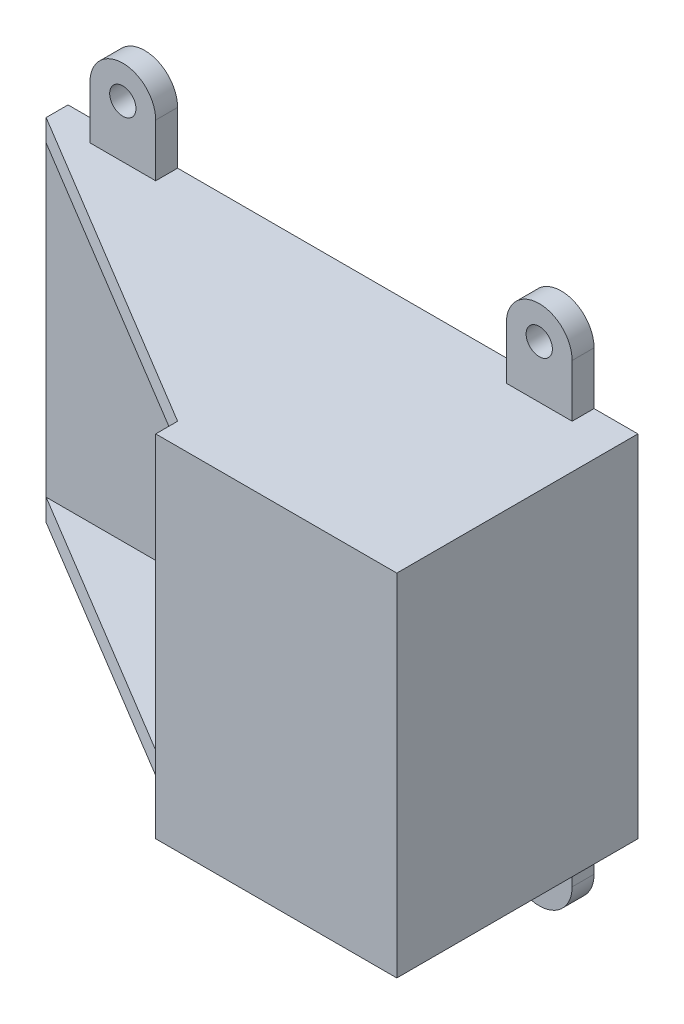
ISO-10303-21;
HEADER;
FILE_DESCRIPTION(('STEP AP214'),'2;1');
FILE_NAME('part.step','',(''),(''),'','','');
FILE_SCHEMA(('AUTOMOTIVE_DESIGN { 1 0 10303 214 1 1 1 1 }'));
ENDSEC;
DATA;
#1=APPLICATION_CONTEXT('core data for automotive mechanical design processes');
#2=APPLICATION_PROTOCOL_DEFINITION('international standard','automotive_design',2000,#1);
#3=PRODUCT_CONTEXT('',#1,'mechanical');
#4=PRODUCT('Part','Part','',(#3));
#5=PRODUCT_RELATED_PRODUCT_CATEGORY('part','',(#4));
#6=PRODUCT_DEFINITION_FORMATION('','',#4);
#7=PRODUCT_DEFINITION_CONTEXT('part definition',#1,'design');
#8=PRODUCT_DEFINITION('design','',#6,#7);
#9=PRODUCT_DEFINITION_SHAPE('','',#8);
#10=(LENGTH_UNIT() NAMED_UNIT(*) SI_UNIT(.MILLI.,.METRE.));
#11=(NAMED_UNIT(*) PLANE_ANGLE_UNIT() SI_UNIT($,.RADIAN.));
#12=(NAMED_UNIT(*) SI_UNIT($,.STERADIAN.) SOLID_ANGLE_UNIT());
#13=UNCERTAINTY_MEASURE_WITH_UNIT(LENGTH_MEASURE(1.E-05),#10,'distance_accuracy_value','');
#14=(GEOMETRIC_REPRESENTATION_CONTEXT(3) GLOBAL_UNCERTAINTY_ASSIGNED_CONTEXT((#13)) GLOBAL_UNIT_ASSIGNED_CONTEXT((#10,
#11,#12)) REPRESENTATION_CONTEXT('',''));
#15=CARTESIAN_POINT('',(0.,0.,0.));
#16=DIRECTION('',(0.,0.,1.));
#17=DIRECTION('',(1.,0.,0.));
#18=AXIS2_PLACEMENT_3D('',#15,#16,#17);
#19=CARTESIAN_POINT('',(0.,75.,0.));
#20=DIRECTION('',(0.,-1.,0.));
#21=DIRECTION('',(0.,0.,-1.));
#22=AXIS2_PLACEMENT_3D('',#19,#20,#21);
#23=PLANE('',#22);
#24=DIRECTION('',(1.,0.,0.));
#25=VECTOR('',#24,1.);
#26=CARTESIAN_POINT('',(95.,75.,5.));
#27=LINE('',#26,#25);
#28=CARTESIAN_POINT('',(105.,75.,5.));
#29=VERTEX_POINT('',#28);
#30=CARTESIAN_POINT('',(120.,75.,5.));
#31=VERTEX_POINT('',#30);
#32=EDGE_CURVE('E234',#29,#31,#27,.T.);
#33=ORIENTED_EDGE('',*,*,#32,.F.);
#34=DIRECTION('',(0.,0.,-1.));
#35=VECTOR('',#34,1.);
#36=CARTESIAN_POINT('',(105.,75.,5.));
#37=LINE('',#36,#35);
#38=CARTESIAN_POINT('',(105.,75.,0.));
#39=VERTEX_POINT('',#38);
#40=EDGE_CURVE('E219',#29,#39,#37,.T.);
#41=ORIENTED_EDGE('',*,*,#40,.T.);
#42=DIRECTION('',(1.,0.,0.));
#43=VECTOR('',#42,1.);
#44=CARTESIAN_POINT('',(0.,75.,0.));
#45=LINE('',#44,#43);
#46=CARTESIAN_POINT('',(25.,75.,0.));
#47=VERTEX_POINT('',#46);
#48=EDGE_CURVE('E397',#47,#39,#45,.T.);
#49=ORIENTED_EDGE('',*,*,#48,.F.);
#50=DIRECTION('',(0.,0.,-1.));
#51=VECTOR('',#50,1.);
#52=CARTESIAN_POINT('',(25.,75.,5.));
#53=LINE('',#52,#51);
#54=CARTESIAN_POINT('',(25.,75.,5.));
#55=VERTEX_POINT('',#54);
#56=EDGE_CURVE('E277',#55,#47,#53,.T.);
#57=ORIENTED_EDGE('',*,*,#56,.F.);
#58=DIRECTION('',(1.,0.,0.));
#59=VECTOR('',#58,1.);
#60=CARTESIAN_POINT('',(0.,75.,5.));
#61=LINE('',#60,#59);
#62=CARTESIAN_POINT('',(10.,75.,5.));
#63=VERTEX_POINT('',#62);
#64=EDGE_CURVE('E260',#63,#55,#61,.T.);
#65=ORIENTED_EDGE('',*,*,#64,.F.);
#66=DIRECTION('',(0.,0.,-1.));
#67=VECTOR('',#66,1.);
#68=CARTESIAN_POINT('',(10.,75.,5.));
#69=LINE('',#68,#67);
#70=CARTESIAN_POINT('',(10.,75.,0.));
#71=VERTEX_POINT('',#70);
#72=EDGE_CURVE('E279',#63,#71,#69,.T.);
#73=ORIENTED_EDGE('',*,*,#72,.T.);
#74=CARTESIAN_POINT('',(0.,75.,0.));
#75=VERTEX_POINT('',#74);
#76=EDGE_CURVE('E394',#75,#71,#45,.T.);
#77=ORIENTED_EDGE('',*,*,#76,.F.);
#78=DIRECTION('',(0.,0.,-1.));
#79=VECTOR('',#78,1.);
#80=CARTESIAN_POINT('',(0.,75.,5.));
#81=LINE('',#80,#79);
#82=CARTESIAN_POINT('',(0.,75.,5.));
#83=VERTEX_POINT('',#82);
#84=EDGE_CURVE('E379',#83,#75,#81,.T.);
#85=ORIENTED_EDGE('',*,*,#84,.F.);
#86=DIRECTION('',(-0.857492925712544,0.,-0.514495755427527));
#87=VECTOR('',#86,1.);
#88=CARTESIAN_POINT('',(75.,75.,50.));
#89=LINE('',#88,#87);
#90=CARTESIAN_POINT('',(75.,75.,50.));
#91=VERTEX_POINT('',#90);
#92=EDGE_CURVE('E385',#91,#83,#89,.T.);
#93=ORIENTED_EDGE('',*,*,#92,.F.);
#94=DIRECTION('',(0.,0.,-1.));
#95=VECTOR('',#94,1.);
#96=CARTESIAN_POINT('',(75.,75.,55.));
#97=LINE('',#96,#95);
#98=CARTESIAN_POINT('',(75.,75.,55.));
#99=VERTEX_POINT('',#98);
#100=EDGE_CURVE('E367',#99,#91,#97,.T.);
#101=ORIENTED_EDGE('',*,*,#100,.F.);
#102=DIRECTION('',(-1.,0.,0.));
#103=VECTOR('',#102,1.);
#104=CARTESIAN_POINT('',(130.,75.,55.));
#105=LINE('',#104,#103);
#106=CARTESIAN_POINT('',(130.,75.,55.));
#107=VERTEX_POINT('',#106);
#108=EDGE_CURVE('E355',#107,#99,#105,.T.);
#109=ORIENTED_EDGE('',*,*,#108,.F.);
#110=DIRECTION('',(0.,0.,1.));
#111=VECTOR('',#110,1.);
#112=CARTESIAN_POINT('',(130.,75.,0.));
#113=LINE('',#112,#111);
#114=CARTESIAN_POINT('',(130.,75.,0.));
#115=VERTEX_POINT('',#114);
#116=EDGE_CURVE('E374',#115,#107,#113,.T.);
#117=ORIENTED_EDGE('',*,*,#116,.F.);
#118=CARTESIAN_POINT('',(120.,75.,0.));
#119=VERTEX_POINT('',#118);
#120=EDGE_CURVE('E393',#119,#115,#45,.T.);
#121=ORIENTED_EDGE('',*,*,#120,.F.);
#122=DIRECTION('',(0.,0.,-1.));
#123=VECTOR('',#122,1.);
#124=CARTESIAN_POINT('',(120.,75.,5.));
#125=LINE('',#124,#123);
#126=EDGE_CURVE('E250',#31,#119,#125,.T.);
#127=ORIENTED_EDGE('',*,*,#126,.F.);
#128=EDGE_LOOP('',(#33,#41,#49,#57,#65,#73,#77,#85,#93,#101,#109,#117,#121,#127));
#129=FACE_BOUND('',#128,.T.);
#130=ADVANCED_FACE('F35',(#129),#23,.F.);
#131=CARTESIAN_POINT('',(0.,0.,5.));
#132=DIRECTION('',(1.,0.,0.));
#133=DIRECTION('',(0.,0.,-1.));
#134=AXIS2_PLACEMENT_3D('',#131,#132,#133);
#135=PLANE('',#134);
#136=DIRECTION('',(0.,-1.,0.));
#137=VECTOR('',#136,1.);
#138=CARTESIAN_POINT('',(0.,0.,0.));
#139=LINE('',#138,#137);
#140=CARTESIAN_POINT('',(0.,-5.,0.));
#141=VERTEX_POINT('',#140);
#142=EDGE_CURVE('E39',#75,#141,#139,.T.);
#143=ORIENTED_EDGE('',*,*,#142,.T.);
#144=DIRECTION('',(0.,0.,-1.));
#145=VECTOR('',#144,1.);
#146=CARTESIAN_POINT('',(0.,-5.,5.));
#147=LINE('',#146,#145);
#148=CARTESIAN_POINT('',(0.,-5.,5.));
#149=VERTEX_POINT('',#148);
#150=EDGE_CURVE('E404',#149,#141,#147,.T.);
#151=ORIENTED_EDGE('',*,*,#150,.F.);
#152=DIRECTION('',(0.,1.,0.));
#153=VECTOR('',#152,1.);
#154=CARTESIAN_POINT('',(0.,-5.,5.));
#155=LINE('',#154,#153);
#156=CARTESIAN_POINT('',(0.,0.,5.));
#157=VERTEX_POINT('',#156);
#158=EDGE_CURVE('E415',#149,#157,#155,.T.);
#159=ORIENTED_EDGE('',*,*,#158,.T.);
#160=DIRECTION('',(0.,-1.,0.));
#161=VECTOR('',#160,1.);
#162=CARTESIAN_POINT('',(0.,0.,5.));
#163=LINE('',#162,#161);
#164=CARTESIAN_POINT('',(0.,70.,5.));
#165=VERTEX_POINT('',#164);
#166=EDGE_CURVE('E426',#165,#157,#163,.T.);
#167=ORIENTED_EDGE('',*,*,#166,.F.);
#168=DIRECTION('',(0.,1.,0.));
#169=VECTOR('',#168,1.);
#170=CARTESIAN_POINT('',(0.,70.,5.));
#171=LINE('',#170,#169);
#172=EDGE_CURVE('E390',#165,#83,#171,.T.);
#173=ORIENTED_EDGE('',*,*,#172,.T.);
#174=ORIENTED_EDGE('',*,*,#84,.T.);
#175=EDGE_LOOP('',(#143,#151,#159,#167,#173,#174));
#176=FACE_BOUND('',#175,.T.);
#177=ADVANCED_FACE('F37',(#176),#135,.F.);
#178=CARTESIAN_POINT('',(0.,0.,5.));
#179=DIRECTION('',(0.,0.,-1.));
#180=DIRECTION('',(-1.,0.,0.));
#181=AXIS2_PLACEMENT_3D('',#178,#179,#180);
#182=PLANE('',#181);
#183=ORIENTED_EDGE('',*,*,#166,.T.);
#184=DIRECTION('',(1.,0.,0.));
#185=VECTOR('',#184,1.);
#186=CARTESIAN_POINT('',(0.,0.,5.));
#187=LINE('',#186,#185);
#188=CARTESIAN_POINT('',(125.,0.,5.));
#189=VERTEX_POINT('',#188);
#190=EDGE_CURVE('E429',#157,#189,#187,.T.);
#191=ORIENTED_EDGE('',*,*,#190,.T.);
#192=DIRECTION('',(0.,1.,0.));
#193=VECTOR('',#192,1.);
#194=CARTESIAN_POINT('',(125.,0.,5.));
#195=LINE('',#194,#193);
#196=CARTESIAN_POINT('',(125.,70.,5.));
#197=VERTEX_POINT('',#196);
#198=EDGE_CURVE('E44',#189,#197,#195,.T.);
#199=ORIENTED_EDGE('',*,*,#198,.T.);
#200=DIRECTION('',(-1.,0.,0.));
#201=VECTOR('',#200,1.);
#202=CARTESIAN_POINT('',(0.,70.,5.));
#203=LINE('',#202,#201);
#204=EDGE_CURVE('E11',#197,#165,#203,.T.);
#205=ORIENTED_EDGE('',*,*,#204,.T.);
#206=EDGE_LOOP('',(#183,#191,#199,#205));
#207=FACE_BOUND('',#206,.T.);
#208=ADVANCED_FACE('F436',(#207),#182,.F.);
#209=CARTESIAN_POINT('',(0.,0.,0.));
#210=DIRECTION('',(0.,0.,-1.));
#211=DIRECTION('',(-1.,0.,0.));
#212=AXIS2_PLACEMENT_3D('',#209,#210,#211);
#213=PLANE('',#212);
#214=ORIENTED_EDGE('',*,*,#142,.F.);
#215=ORIENTED_EDGE('',*,*,#76,.T.);
#216=DIRECTION('',(0.,1.,0.));
#217=VECTOR('',#216,1.);
#218=CARTESIAN_POINT('',(10.,70.,0.));
#219=LINE('',#218,#217);
#220=CARTESIAN_POINT('',(10.,87.,0.));
#221=VERTEX_POINT('',#220);
#222=EDGE_CURVE('E59',#71,#221,#219,.T.);
#223=ORIENTED_EDGE('',*,*,#222,.T.);
#224=CARTESIAN_POINT('',(17.5,87.,0.));
#225=DIRECTION('',(0.,0.,-1.));
#226=DIRECTION('',(1.,0.,0.));
#227=AXIS2_PLACEMENT_3D('',#224,#225,#226);
#228=CIRCLE('',#227,7.5);
#229=CARTESIAN_POINT('',(25.,87.,0.));
#230=VERTEX_POINT('',#229);
#231=EDGE_CURVE('E218',#221,#230,#228,.T.);
#232=ORIENTED_EDGE('',*,*,#231,.T.);
#233=DIRECTION('',(0.,1.,0.));
#234=VECTOR('',#233,1.);
#235=CARTESIAN_POINT('',(25.,70.,0.));
#236=LINE('',#235,#234);
#237=EDGE_CURVE('E271',#47,#230,#236,.T.);
#238=ORIENTED_EDGE('',*,*,#237,.F.);
#239=ORIENTED_EDGE('',*,*,#48,.T.);
#240=DIRECTION('',(0.,1.,0.));
#241=VECTOR('',#240,1.);
#242=CARTESIAN_POINT('',(105.,70.,0.));
#243=LINE('',#242,#241);
#244=CARTESIAN_POINT('',(105.,87.,0.));
#245=VERTEX_POINT('',#244);
#246=EDGE_CURVE('E244',#39,#245,#243,.T.);
#247=ORIENTED_EDGE('',*,*,#246,.T.);
#248=CARTESIAN_POINT('',(112.5,87.,0.));
#249=DIRECTION('',(0.,0.,-1.));
#250=DIRECTION('',(1.,0.,0.));
#251=AXIS2_PLACEMENT_3D('',#248,#249,#250);
#252=CIRCLE('',#251,7.5);
#253=CARTESIAN_POINT('',(120.,87.,0.));
#254=VERTEX_POINT('',#253);
#255=EDGE_CURVE('E214',#245,#254,#252,.T.);
#256=ORIENTED_EDGE('',*,*,#255,.T.);
#257=DIRECTION('',(0.,1.,0.));
#258=VECTOR('',#257,1.);
#259=CARTESIAN_POINT('',(120.,70.,0.));
#260=LINE('',#259,#258);
#261=EDGE_CURVE('E51',#119,#254,#260,.T.);
#262=ORIENTED_EDGE('',*,*,#261,.F.);
#263=ORIENTED_EDGE('',*,*,#120,.T.);
#264=DIRECTION('',(0.,1.,0.));
#265=VECTOR('',#264,1.);
#266=CARTESIAN_POINT('',(130.,-5.,0.));
#267=LINE('',#266,#265);
#268=CARTESIAN_POINT('',(130.,-5.,0.));
#269=VERTEX_POINT('',#268);
#270=EDGE_CURVE('E371',#269,#115,#267,.T.);
#271=ORIENTED_EDGE('',*,*,#270,.F.);
#272=DIRECTION('',(1.,0.,0.));
#273=VECTOR('',#272,1.);
#274=CARTESIAN_POINT('',(0.,-5.,0.));
#275=LINE('',#274,#273);
#276=CARTESIAN_POINT('',(120.,-5.,0.));
#277=VERTEX_POINT('',#276);
#278=EDGE_CURVE('E407',#277,#269,#275,.T.);
#279=ORIENTED_EDGE('',*,*,#278,.F.);
#280=DIRECTION('',(0.,-1.,0.));
#281=VECTOR('',#280,1.);
#282=CARTESIAN_POINT('',(120.,0.,0.));
#283=LINE('',#282,#281);
#284=CARTESIAN_POINT('',(120.,-17.,0.));
#285=VERTEX_POINT('',#284);
#286=EDGE_CURVE('E300',#277,#285,#283,.T.);
#287=ORIENTED_EDGE('',*,*,#286,.T.);
#288=CARTESIAN_POINT('',(112.5,-17.,0.));
#289=DIRECTION('',(0.,0.,1.));
#290=DIRECTION('',(1.,0.,0.));
#291=AXIS2_PLACEMENT_3D('',#288,#289,#290);
#292=CIRCLE('',#291,7.5);
#293=CARTESIAN_POINT('',(105.,-17.,0.));
#294=VERTEX_POINT('',#293);
#295=EDGE_CURVE('E283',#294,#285,#292,.T.);
#296=ORIENTED_EDGE('',*,*,#295,.F.);
#297=DIRECTION('',(0.,-1.,0.));
#298=VECTOR('',#297,1.);
#299=CARTESIAN_POINT('',(105.,0.,0.));
#300=LINE('',#299,#298);
#301=CARTESIAN_POINT('',(105.,-5.,0.));
#302=VERTEX_POINT('',#301);
#303=EDGE_CURVE('E303',#302,#294,#300,.T.);
#304=ORIENTED_EDGE('',*,*,#303,.F.);
#305=CARTESIAN_POINT('',(25.,-5.,0.));
#306=VERTEX_POINT('',#305);
#307=EDGE_CURVE('E413',#306,#302,#275,.T.);
#308=ORIENTED_EDGE('',*,*,#307,.F.);
#309=DIRECTION('',(0.,-1.,0.));
#310=VECTOR('',#309,1.);
#311=CARTESIAN_POINT('',(25.,0.,0.));
#312=LINE('',#311,#310);
#313=CARTESIAN_POINT('',(25.,-17.,0.));
#314=VERTEX_POINT('',#313);
#315=EDGE_CURVE('E335',#306,#314,#312,.T.);
#316=ORIENTED_EDGE('',*,*,#315,.T.);
#317=CARTESIAN_POINT('',(17.5,-17.,0.));
#318=DIRECTION('',(0.,0.,1.));
#319=DIRECTION('',(1.,0.,0.));
#320=AXIS2_PLACEMENT_3D('',#317,#318,#319);
#321=CIRCLE('',#320,7.5);
#322=CARTESIAN_POINT('',(10.,-17.,0.));
#323=VERTEX_POINT('',#322);
#324=EDGE_CURVE('E317',#323,#314,#321,.T.);
#325=ORIENTED_EDGE('',*,*,#324,.F.);
#326=DIRECTION('',(0.,-1.,0.));
#327=VECTOR('',#326,1.);
#328=CARTESIAN_POINT('',(10.,0.,0.));
#329=LINE('',#328,#327);
#330=CARTESIAN_POINT('',(10.,-5.,0.));
#331=VERTEX_POINT('',#330);
#332=EDGE_CURVE('E338',#331,#323,#329,.T.);
#333=ORIENTED_EDGE('',*,*,#332,.F.);
#334=EDGE_CURVE('E409',#141,#331,#275,.T.);
#335=ORIENTED_EDGE('',*,*,#334,.F.);
#336=EDGE_LOOP('',(#214,#215,#223,#232,#238,#239,#247,#256,#262,#263,#271,#279,#287,#296,#304,
#308,#316,#325,#333,#335));
#337=FACE_BOUND('',#336,.T.);
#338=CARTESIAN_POINT('',(17.5,-17.,0.));
#339=DIRECTION('',(0.,0.,1.));
#340=DIRECTION('',(1.,0.,0.));
#341=AXIS2_PLACEMENT_3D('',#338,#339,#340);
#342=CIRCLE('',#341,2.99999999999999);
#343=CARTESIAN_POINT('',(20.5,-17.,0.));
#344=VERTEX_POINT('',#343);
#345=EDGE_CURVE('E321',#344,#344,#342,.T.);
#346=ORIENTED_EDGE('',*,*,#345,.T.);
#347=EDGE_LOOP('',(#346));
#348=FACE_BOUND('',#347,.T.);
#349=CARTESIAN_POINT('',(112.5,-17.,0.));
#350=DIRECTION('',(0.,0.,1.));
#351=DIRECTION('',(1.,0.,0.));
#352=AXIS2_PLACEMENT_3D('',#349,#350,#351);
#353=CIRCLE('',#352,2.99999999999999);
#354=CARTESIAN_POINT('',(115.5,-17.,0.));
#355=VERTEX_POINT('',#354);
#356=EDGE_CURVE('E287',#355,#355,#353,.T.);
#357=ORIENTED_EDGE('',*,*,#356,.T.);
#358=EDGE_LOOP('',(#357));
#359=FACE_BOUND('',#358,.T.);
#360=CARTESIAN_POINT('',(17.5,87.,0.));
#361=DIRECTION('',(0.,0.,-1.));
#362=DIRECTION('',(1.,0.,0.));
#363=AXIS2_PLACEMENT_3D('',#360,#361,#362);
#364=CIRCLE('',#363,2.99999999999999);
#365=CARTESIAN_POINT('',(20.5,87.,0.));
#366=VERTEX_POINT('',#365);
#367=EDGE_CURVE('E257',#366,#366,#364,.T.);
#368=ORIENTED_EDGE('',*,*,#367,.F.);
#369=EDGE_LOOP('',(#368));
#370=FACE_BOUND('',#369,.T.);
#371=CARTESIAN_POINT('',(112.5,87.,0.));
#372=DIRECTION('',(0.,0.,-1.));
#373=DIRECTION('',(1.,0.,0.));
#374=AXIS2_PLACEMENT_3D('',#371,#372,#373);
#375=CIRCLE('',#374,2.99999999999999);
#376=CARTESIAN_POINT('',(115.5,87.,0.));
#377=VERTEX_POINT('',#376);
#378=EDGE_CURVE('E230',#377,#377,#375,.T.);
#379=ORIENTED_EDGE('',*,*,#378,.F.);
#380=EDGE_LOOP('',(#379));
#381=FACE_BOUND('',#380,.T.);
#382=ADVANCED_FACE('F710',(#337,#348,#359,#370,#381),#213,.T.);
#383=CARTESIAN_POINT('',(75.,-5.,50.));
#384=DIRECTION('',(0.514495755427526,0.,-0.857492925712544));
#385=DIRECTION('',(-0.857492925712544,0.,-0.514495755427527));
#386=AXIS2_PLACEMENT_3D('',#383,#384,#385);
#387=PLANE('',#386);
#388=DIRECTION('',(-0.857492925712544,0.,-0.514495755427527));
#389=VECTOR('',#388,1.);
#390=CARTESIAN_POINT('',(75.,0.,50.));
#391=LINE('',#390,#389);
#392=CARTESIAN_POINT('',(75.,0.,50.));
#393=VERTEX_POINT('',#392);
#394=EDGE_CURVE('E408',#393,#157,#391,.T.);
#395=ORIENTED_EDGE('',*,*,#394,.T.);
#396=ORIENTED_EDGE('',*,*,#158,.F.);
#397=DIRECTION('',(-0.857492925712544,0.,-0.514495755427527));
#398=VECTOR('',#397,1.);
#399=CARTESIAN_POINT('',(75.,-5.,50.));
#400=LINE('',#399,#398);
#401=CARTESIAN_POINT('',(75.,-5.,50.));
#402=VERTEX_POINT('',#401);
#403=EDGE_CURVE('E412',#402,#149,#400,.T.);
#404=ORIENTED_EDGE('',*,*,#403,.F.);
#405=DIRECTION('',(0.,1.,0.));
#406=VECTOR('',#405,1.);
#407=CARTESIAN_POINT('',(75.,-5.,50.));
#408=LINE('',#407,#406);
#409=EDGE_CURVE('E424',#402,#393,#408,.T.);
#410=ORIENTED_EDGE('',*,*,#409,.T.);
#411=EDGE_LOOP('',(#395,#396,#404,#410));
#412=FACE_BOUND('',#411,.T.);
#413=ADVANCED_FACE('F468',(#412),#387,.F.);
#414=CARTESIAN_POINT('',(0.,-5.,0.));
#415=DIRECTION('',(0.,-1.,0.));
#416=DIRECTION('',(0.,0.,-1.));
#417=AXIS2_PLACEMENT_3D('',#414,#415,#416);
#418=PLANE('',#417);
#419=DIRECTION('',(0.,0.,-1.));
#420=VECTOR('',#419,1.);
#421=CARTESIAN_POINT('',(120.,-5.,5.));
#422=LINE('',#421,#420);
#423=CARTESIAN_POINT('',(120.,-5.,5.));
#424=VERTEX_POINT('',#423);
#425=EDGE_CURVE('E312',#424,#277,#422,.T.);
#426=ORIENTED_EDGE('',*,*,#425,.T.);
#427=ORIENTED_EDGE('',*,*,#278,.T.);
#428=DIRECTION('',(0.,0.,-1.));
#429=VECTOR('',#428,1.);
#430=CARTESIAN_POINT('',(130.,-5.,0.));
#431=LINE('',#430,#429);
#432=CARTESIAN_POINT('',(130.,-5.,55.));
#433=VERTEX_POINT('',#432);
#434=EDGE_CURVE('E376',#433,#269,#431,.T.);
#435=ORIENTED_EDGE('',*,*,#434,.F.);
#436=DIRECTION('',(1.,0.,0.));
#437=VECTOR('',#436,1.);
#438=CARTESIAN_POINT('',(130.,-5.,55.));
#439=LINE('',#438,#437);
#440=CARTESIAN_POINT('',(75.,-5.00000000000001,55.));
#441=VERTEX_POINT('',#440);
#442=EDGE_CURVE('E359',#441,#433,#439,.T.);
#443=ORIENTED_EDGE('',*,*,#442,.F.);
#444=DIRECTION('',(0.,0.,-1.));
#445=VECTOR('',#444,1.);
#446=CARTESIAN_POINT('',(75.,-5.00000000000001,55.));
#447=LINE('',#446,#445);
#448=EDGE_CURVE('E362',#441,#402,#447,.T.);
#449=ORIENTED_EDGE('',*,*,#448,.T.);
#450=ORIENTED_EDGE('',*,*,#403,.T.);
#451=ORIENTED_EDGE('',*,*,#150,.T.);
#452=ORIENTED_EDGE('',*,*,#334,.T.);
#453=DIRECTION('',(0.,0.,-1.));
#454=VECTOR('',#453,1.);
#455=CARTESIAN_POINT('',(10.,-5.,5.));
#456=LINE('',#455,#454);
#457=CARTESIAN_POINT('',(10.,-5.,5.));
#458=VERTEX_POINT('',#457);
#459=EDGE_CURVE('E344',#458,#331,#456,.T.);
#460=ORIENTED_EDGE('',*,*,#459,.F.);
#461=DIRECTION('',(1.,0.,0.));
#462=VECTOR('',#461,1.);
#463=CARTESIAN_POINT('',(0.,-5.,5.));
#464=LINE('',#463,#462);
#465=CARTESIAN_POINT('',(25.,-5.,5.));
#466=VERTEX_POINT('',#465);
#467=EDGE_CURVE('E324',#458,#466,#464,.T.);
#468=ORIENTED_EDGE('',*,*,#467,.T.);
#469=DIRECTION('',(0.,0.,-1.));
#470=VECTOR('',#469,1.);
#471=CARTESIAN_POINT('',(25.,-5.,5.));
#472=LINE('',#471,#470);
#473=EDGE_CURVE('E346',#466,#306,#472,.T.);
#474=ORIENTED_EDGE('',*,*,#473,.T.);
#475=ORIENTED_EDGE('',*,*,#307,.T.);
#476=DIRECTION('',(0.,0.,-1.));
#477=VECTOR('',#476,1.);
#478=CARTESIAN_POINT('',(105.,-5.,5.));
#479=LINE('',#478,#477);
#480=CARTESIAN_POINT('',(105.,-5.,5.));
#481=VERTEX_POINT('',#480);
#482=EDGE_CURVE('E309',#481,#302,#479,.T.);
#483=ORIENTED_EDGE('',*,*,#482,.F.);
#484=DIRECTION('',(1.,0.,0.));
#485=VECTOR('',#484,1.);
#486=CARTESIAN_POINT('',(95.,-5.,5.));
#487=LINE('',#486,#485);
#488=EDGE_CURVE('E290',#481,#424,#487,.T.);
#489=ORIENTED_EDGE('',*,*,#488,.T.);
#490=EDGE_LOOP('',(#426,#427,#435,#443,#449,#450,#451,#452,#460,#468,#474,#475,#483,#489));
#491=FACE_BOUND('',#490,.T.);
#492=ADVANCED_FACE('F473',(#491),#418,.T.);
#493=CARTESIAN_POINT('',(0.,0.,0.));
#494=DIRECTION('',(0.,-1.,0.));
#495=DIRECTION('',(0.,0.,-1.));
#496=AXIS2_PLACEMENT_3D('',#493,#494,#495);
#497=PLANE('',#496);
#498=ORIENTED_EDGE('',*,*,#190,.F.);
#499=ORIENTED_EDGE('',*,*,#394,.F.);
#500=DIRECTION('',(-1.,0.,0.));
#501=VECTOR('',#500,1.);
#502=CARTESIAN_POINT('',(125.,0.,50.));
#503=LINE('',#502,#501);
#504=CARTESIAN_POINT('',(125.,0.,50.));
#505=VERTEX_POINT('',#504);
#506=EDGE_CURVE('E417',#505,#393,#503,.T.);
#507=ORIENTED_EDGE('',*,*,#506,.F.);
#508=DIRECTION('',(0.,0.,1.));
#509=VECTOR('',#508,1.);
#510=CARTESIAN_POINT('',(125.,0.,0.));
#511=LINE('',#510,#509);
#512=EDGE_CURVE('E403',#189,#505,#511,.T.);
#513=ORIENTED_EDGE('',*,*,#512,.F.);
#514=EDGE_LOOP('',(#498,#499,#507,#513));
#515=FACE_BOUND('',#514,.T.);
#516=ADVANCED_FACE('F471',(#515),#497,.F.);
#517=CARTESIAN_POINT('',(0.,70.,0.));
#518=DIRECTION('',(0.,-1.,0.));
#519=DIRECTION('',(0.,0.,-1.));
#520=AXIS2_PLACEMENT_3D('',#517,#518,#519);
#521=PLANE('',#520);
#522=ORIENTED_EDGE('',*,*,#204,.F.);
#523=DIRECTION('',(0.,0.,1.));
#524=VECTOR('',#523,1.);
#525=CARTESIAN_POINT('',(125.,70.,0.));
#526=LINE('',#525,#524);
#527=CARTESIAN_POINT('',(125.,70.,50.));
#528=VERTEX_POINT('',#527);
#529=EDGE_CURVE('E382',#197,#528,#526,.T.);
#530=ORIENTED_EDGE('',*,*,#529,.T.);
#531=DIRECTION('',(-1.,0.,0.));
#532=VECTOR('',#531,1.);
#533=CARTESIAN_POINT('',(125.,70.,50.));
#534=LINE('',#533,#532);
#535=CARTESIAN_POINT('',(75.,70.,50.));
#536=VERTEX_POINT('',#535);
#537=EDGE_CURVE('E384',#528,#536,#534,.T.);
#538=ORIENTED_EDGE('',*,*,#537,.T.);
#539=DIRECTION('',(-0.857492925712544,0.,-0.514495755427527));
#540=VECTOR('',#539,1.);
#541=CARTESIAN_POINT('',(75.,70.,50.));
#542=LINE('',#541,#540);
#543=EDGE_CURVE('E387',#536,#165,#542,.T.);
#544=ORIENTED_EDGE('',*,*,#543,.T.);
#545=EDGE_LOOP('',(#522,#530,#538,#544));
#546=FACE_BOUND('',#545,.T.);
#547=ADVANCED_FACE('F443',(#546),#521,.T.);
#548=CARTESIAN_POINT('',(75.,70.,50.));
#549=DIRECTION('',(0.514495755427526,0.,-0.857492925712544));
#550=DIRECTION('',(-0.857492925712544,0.,-0.514495755427527));
#551=AXIS2_PLACEMENT_3D('',#548,#549,#550);
#552=PLANE('',#551);
#553=ORIENTED_EDGE('',*,*,#92,.T.);
#554=ORIENTED_EDGE('',*,*,#172,.F.);
#555=ORIENTED_EDGE('',*,*,#543,.F.);
#556=DIRECTION('',(0.,1.,0.));
#557=VECTOR('',#556,1.);
#558=CARTESIAN_POINT('',(75.,70.,50.));
#559=LINE('',#558,#557);
#560=EDGE_CURVE('E401',#536,#91,#559,.T.);
#561=ORIENTED_EDGE('',*,*,#560,.T.);
#562=EDGE_LOOP('',(#553,#554,#555,#561));
#563=FACE_BOUND('',#562,.T.);
#564=ADVANCED_FACE('F447',(#563),#552,.F.);
#565=CARTESIAN_POINT('',(130.,0.,0.));
#566=DIRECTION('',(1.,0.,0.));
#567=DIRECTION('',(0.,0.,-1.));
#568=AXIS2_PLACEMENT_3D('',#565,#566,#567);
#569=PLANE('',#568);
#570=ORIENTED_EDGE('',*,*,#270,.T.);
#571=ORIENTED_EDGE('',*,*,#116,.T.);
#572=DIRECTION('',(0.,1.,0.));
#573=VECTOR('',#572,1.);
#574=CARTESIAN_POINT('',(130.,-5.,55.));
#575=LINE('',#574,#573);
#576=EDGE_CURVE('E352',#433,#107,#575,.T.);
#577=ORIENTED_EDGE('',*,*,#576,.F.);
#578=ORIENTED_EDGE('',*,*,#434,.T.);
#579=EDGE_LOOP('',(#570,#571,#577,#578));
#580=FACE_BOUND('',#579,.T.);
#581=ADVANCED_FACE('F491',(#580),#569,.T.);
#582=CARTESIAN_POINT('',(125.,0.,0.));
#583=DIRECTION('',(1.,0.,0.));
#584=DIRECTION('',(0.,0.,-1.));
#585=AXIS2_PLACEMENT_3D('',#582,#583,#584);
#586=PLANE('',#585);
#587=ORIENTED_EDGE('',*,*,#529,.F.);
#588=ORIENTED_EDGE('',*,*,#198,.F.);
#589=ORIENTED_EDGE('',*,*,#512,.T.);
#590=DIRECTION('',(0.,-1.,0.));
#591=VECTOR('',#590,1.);
#592=CARTESIAN_POINT('',(125.,-5.00000000000001,50.));
#593=LINE('',#592,#591);
#594=EDGE_CURVE('E370',#528,#505,#593,.T.);
#595=ORIENTED_EDGE('',*,*,#594,.F.);
#596=EDGE_LOOP('',(#587,#588,#589,#595));
#597=FACE_BOUND('',#596,.T.);
#598=ADVANCED_FACE('F440',(#597),#586,.F.);
#599=CARTESIAN_POINT('',(0.,0.,50.));
#600=DIRECTION('',(0.,0.,1.));
#601=DIRECTION('',(1.,0.,0.));
#602=AXIS2_PLACEMENT_3D('',#599,#600,#601);
#603=PLANE('',#602);
#604=ORIENTED_EDGE('',*,*,#594,.T.);
#605=ORIENTED_EDGE('',*,*,#506,.T.);
#606=DIRECTION('',(0.,-1.,0.));
#607=VECTOR('',#606,1.);
#608=CARTESIAN_POINT('',(75.,-5.00000000000001,50.));
#609=LINE('',#608,#607);
#610=EDGE_CURVE('E351',#536,#393,#609,.T.);
#611=ORIENTED_EDGE('',*,*,#610,.F.);
#612=ORIENTED_EDGE('',*,*,#537,.F.);
#613=EDGE_LOOP('',(#604,#605,#611,#612));
#614=FACE_BOUND('',#613,.T.);
#615=ADVANCED_FACE('F451',(#614),#603,.F.);
#616=CARTESIAN_POINT('',(75.,-5.00000000000001,55.));
#617=DIRECTION('',(1.,0.,0.));
#618=DIRECTION('',(0.,0.,-1.));
#619=AXIS2_PLACEMENT_3D('',#616,#617,#618);
#620=PLANE('',#619);
#621=ORIENTED_EDGE('',*,*,#560,.F.);
#622=ORIENTED_EDGE('',*,*,#610,.T.);
#623=ORIENTED_EDGE('',*,*,#409,.F.);
#624=ORIENTED_EDGE('',*,*,#448,.F.);
#625=DIRECTION('',(0.,-1.,0.));
#626=VECTOR('',#625,1.);
#627=CARTESIAN_POINT('',(75.,-5.00000000000001,55.));
#628=LINE('',#627,#626);
#629=EDGE_CURVE('E357',#99,#441,#628,.T.);
#630=ORIENTED_EDGE('',*,*,#629,.F.);
#631=ORIENTED_EDGE('',*,*,#100,.T.);
#632=EDGE_LOOP('',(#621,#622,#623,#624,#630,#631));
#633=FACE_BOUND('',#632,.T.);
#634=ADVANCED_FACE('F455',(#633),#620,.F.);
#635=CARTESIAN_POINT('',(0.,0.,55.));
#636=DIRECTION('',(0.,0.,1.));
#637=DIRECTION('',(1.,0.,0.));
#638=AXIS2_PLACEMENT_3D('',#635,#636,#637);
#639=PLANE('',#638);
#640=ORIENTED_EDGE('',*,*,#576,.T.);
#641=ORIENTED_EDGE('',*,*,#108,.T.);
#642=ORIENTED_EDGE('',*,*,#629,.T.);
#643=ORIENTED_EDGE('',*,*,#442,.T.);
#644=EDGE_LOOP('',(#640,#641,#642,#643));
#645=FACE_BOUND('',#644,.T.);
#646=ADVANCED_FACE('F503',(#645),#639,.T.);
#647=CARTESIAN_POINT('',(17.5,-17.,5.));
#648=DIRECTION('',(0.,0.,-1.));
#649=DIRECTION('',(-1.,0.,0.));
#650=AXIS2_PLACEMENT_3D('',#647,#648,#649);
#651=CYLINDRICAL_SURFACE('',#650,7.5);
#652=ORIENTED_EDGE('',*,*,#324,.T.);
#653=DIRECTION('',(0.,0.,-1.));
#654=VECTOR('',#653,1.);
#655=CARTESIAN_POINT('',(25.,-17.,5.));
#656=LINE('',#655,#654);
#657=CARTESIAN_POINT('',(25.,-17.,5.));
#658=VERTEX_POINT('',#657);
#659=EDGE_CURVE('E349',#658,#314,#656,.T.);
#660=ORIENTED_EDGE('',*,*,#659,.F.);
#661=CARTESIAN_POINT('',(17.5,-17.,5.));
#662=DIRECTION('',(0.,0.,1.));
#663=DIRECTION('',(1.,0.,0.));
#664=AXIS2_PLACEMENT_3D('',#661,#662,#663);
#665=CIRCLE('',#664,7.5);
#666=CARTESIAN_POINT('',(10.,-17.,5.));
#667=VERTEX_POINT('',#666);
#668=EDGE_CURVE('E318',#667,#658,#665,.T.);
#669=ORIENTED_EDGE('',*,*,#668,.F.);
#670=DIRECTION('',(0.,0.,-1.));
#671=VECTOR('',#670,1.);
#672=CARTESIAN_POINT('',(10.,-17.,5.));
#673=LINE('',#672,#671);
#674=EDGE_CURVE('E332',#667,#323,#673,.T.);
#675=ORIENTED_EDGE('',*,*,#674,.T.);
#676=EDGE_LOOP('',(#652,#660,#669,#675));
#677=FACE_BOUND('',#676,.T.);
#678=ADVANCED_FACE('F508',(#677),#651,.T.);
#679=CARTESIAN_POINT('',(25.,0.,5.));
#680=DIRECTION('',(1.,0.,0.));
#681=DIRECTION('',(0.,1.,0.));
#682=AXIS2_PLACEMENT_3D('',#679,#680,#681);
#683=PLANE('',#682);
#684=ORIENTED_EDGE('',*,*,#315,.F.);
#685=ORIENTED_EDGE('',*,*,#473,.F.);
#686=DIRECTION('',(0.,-1.,0.));
#687=VECTOR('',#686,1.);
#688=CARTESIAN_POINT('',(25.,0.,5.));
#689=LINE('',#688,#687);
#690=EDGE_CURVE('E320',#466,#658,#689,.T.);
#691=ORIENTED_EDGE('',*,*,#690,.T.);
#692=ORIENTED_EDGE('',*,*,#659,.T.);
#693=EDGE_LOOP('',(#684,#685,#691,#692));
#694=FACE_BOUND('',#693,.T.);
#695=ADVANCED_FACE('F512',(#694),#683,.T.);
#696=CARTESIAN_POINT('',(10.,0.,5.));
#697=DIRECTION('',(1.,0.,0.));
#698=DIRECTION('',(0.,1.,0.));
#699=AXIS2_PLACEMENT_3D('',#696,#697,#698);
#700=PLANE('',#699);
#701=ORIENTED_EDGE('',*,*,#332,.T.);
#702=ORIENTED_EDGE('',*,*,#674,.F.);
#703=DIRECTION('',(0.,-1.,0.));
#704=VECTOR('',#703,1.);
#705=CARTESIAN_POINT('',(10.,0.,5.));
#706=LINE('',#705,#704);
#707=EDGE_CURVE('E327',#458,#667,#706,.T.);
#708=ORIENTED_EDGE('',*,*,#707,.F.);
#709=ORIENTED_EDGE('',*,*,#459,.T.);
#710=EDGE_LOOP('',(#701,#702,#708,#709));
#711=FACE_BOUND('',#710,.T.);
#712=ADVANCED_FACE('F516',(#711),#700,.F.);
#713=CARTESIAN_POINT('',(17.5,-17.,5.));
#714=DIRECTION('',(0.,0.,-1.));
#715=DIRECTION('',(-1.,0.,0.));
#716=AXIS2_PLACEMENT_3D('',#713,#714,#715);
#717=CYLINDRICAL_SURFACE('',#716,2.99999999999999);
#718=CARTESIAN_POINT('',(17.5,-17.,5.));
#719=DIRECTION('',(0.,0.,1.));
#720=DIRECTION('',(1.,0.,0.));
#721=AXIS2_PLACEMENT_3D('',#718,#719,#720);
#722=CIRCLE('',#721,2.99999999999999);
#723=CARTESIAN_POINT('',(20.5,-17.,5.));
#724=VERTEX_POINT('',#723);
#725=EDGE_CURVE('E329',#724,#724,#722,.T.);
#726=ORIENTED_EDGE('',*,*,#725,.T.);
#727=EDGE_LOOP('',(#726));
#728=FACE_BOUND('',#727,.T.);
#729=ORIENTED_EDGE('',*,*,#345,.F.);
#730=EDGE_LOOP('',(#729));
#731=FACE_BOUND('',#730,.T.);
#732=ADVANCED_FACE('F520',(#728,#731),#717,.F.);
#733=CARTESIAN_POINT('',(0.,0.,5.));
#734=DIRECTION('',(0.,0.,1.));
#735=DIRECTION('',(1.,0.,0.));
#736=AXIS2_PLACEMENT_3D('',#733,#734,#735);
#737=PLANE('',#736);
#738=ORIENTED_EDGE('',*,*,#668,.T.);
#739=ORIENTED_EDGE('',*,*,#690,.F.);
#740=ORIENTED_EDGE('',*,*,#467,.F.);
#741=ORIENTED_EDGE('',*,*,#707,.T.);
#742=EDGE_LOOP('',(#738,#739,#740,#741));
#743=FACE_BOUND('',#742,.T.);
#744=ORIENTED_EDGE('',*,*,#725,.F.);
#745=EDGE_LOOP('',(#744));
#746=FACE_BOUND('',#745,.T.);
#747=ADVANCED_FACE('F524',(#743,#746),#737,.T.);
#748=CARTESIAN_POINT('',(112.5,-17.,5.));
#749=DIRECTION('',(0.,0.,-1.));
#750=DIRECTION('',(-1.,0.,0.));
#751=AXIS2_PLACEMENT_3D('',#748,#749,#750);
#752=CYLINDRICAL_SURFACE('',#751,7.5);
#753=ORIENTED_EDGE('',*,*,#295,.T.);
#754=DIRECTION('',(0.,0.,-1.));
#755=VECTOR('',#754,1.);
#756=CARTESIAN_POINT('',(120.,-17.,5.));
#757=LINE('',#756,#755);
#758=CARTESIAN_POINT('',(120.,-17.,5.));
#759=VERTEX_POINT('',#758);
#760=EDGE_CURVE('E315',#759,#285,#757,.T.);
#761=ORIENTED_EDGE('',*,*,#760,.F.);
#762=CARTESIAN_POINT('',(112.5,-17.,5.));
#763=DIRECTION('',(0.,0.,1.));
#764=DIRECTION('',(1.,0.,0.));
#765=AXIS2_PLACEMENT_3D('',#762,#763,#764);
#766=CIRCLE('',#765,7.5);
#767=CARTESIAN_POINT('',(105.,-17.,5.));
#768=VERTEX_POINT('',#767);
#769=EDGE_CURVE('E284',#768,#759,#766,.T.);
#770=ORIENTED_EDGE('',*,*,#769,.F.);
#771=DIRECTION('',(0.,0.,-1.));
#772=VECTOR('',#771,1.);
#773=CARTESIAN_POINT('',(105.,-17.,5.));
#774=LINE('',#773,#772);
#775=EDGE_CURVE('E297',#768,#294,#774,.T.);
#776=ORIENTED_EDGE('',*,*,#775,.T.);
#777=EDGE_LOOP('',(#753,#761,#770,#776));
#778=FACE_BOUND('',#777,.T.);
#779=ADVANCED_FACE('F528',(#778),#752,.T.);
#780=CARTESIAN_POINT('',(120.,0.,5.));
#781=DIRECTION('',(1.,0.,0.));
#782=DIRECTION('',(0.,1.,0.));
#783=AXIS2_PLACEMENT_3D('',#780,#781,#782);
#784=PLANE('',#783);
#785=ORIENTED_EDGE('',*,*,#286,.F.);
#786=ORIENTED_EDGE('',*,*,#425,.F.);
#787=DIRECTION('',(0.,-1.,0.));
#788=VECTOR('',#787,1.);
#789=CARTESIAN_POINT('',(120.,0.,5.));
#790=LINE('',#789,#788);
#791=EDGE_CURVE('E286',#424,#759,#790,.T.);
#792=ORIENTED_EDGE('',*,*,#791,.T.);
#793=ORIENTED_EDGE('',*,*,#760,.T.);
#794=EDGE_LOOP('',(#785,#786,#792,#793));
#795=FACE_BOUND('',#794,.T.);
#796=ADVANCED_FACE('F532',(#795),#784,.T.);
#797=CARTESIAN_POINT('',(105.,0.,5.));
#798=DIRECTION('',(1.,0.,0.));
#799=DIRECTION('',(0.,1.,0.));
#800=AXIS2_PLACEMENT_3D('',#797,#798,#799);
#801=PLANE('',#800);
#802=ORIENTED_EDGE('',*,*,#303,.T.);
#803=ORIENTED_EDGE('',*,*,#775,.F.);
#804=DIRECTION('',(0.,-1.,0.));
#805=VECTOR('',#804,1.);
#806=CARTESIAN_POINT('',(105.,0.,5.));
#807=LINE('',#806,#805);
#808=EDGE_CURVE('E292',#481,#768,#807,.T.);
#809=ORIENTED_EDGE('',*,*,#808,.F.);
#810=ORIENTED_EDGE('',*,*,#482,.T.);
#811=EDGE_LOOP('',(#802,#803,#809,#810));
#812=FACE_BOUND('',#811,.T.);
#813=ADVANCED_FACE('F536',(#812),#801,.F.);
#814=CARTESIAN_POINT('',(112.5,-17.,5.));
#815=DIRECTION('',(0.,0.,-1.));
#816=DIRECTION('',(-1.,0.,0.));
#817=AXIS2_PLACEMENT_3D('',#814,#815,#816);
#818=CYLINDRICAL_SURFACE('',#817,2.99999999999999);
#819=CARTESIAN_POINT('',(112.5,-17.,5.));
#820=DIRECTION('',(0.,0.,1.));
#821=DIRECTION('',(1.,0.,0.));
#822=AXIS2_PLACEMENT_3D('',#819,#820,#821);
#823=CIRCLE('',#822,2.99999999999999);
#824=CARTESIAN_POINT('',(115.5,-17.,5.));
#825=VERTEX_POINT('',#824);
#826=EDGE_CURVE('E294',#825,#825,#823,.T.);
#827=ORIENTED_EDGE('',*,*,#826,.T.);
#828=EDGE_LOOP('',(#827));
#829=FACE_BOUND('',#828,.T.);
#830=ORIENTED_EDGE('',*,*,#356,.F.);
#831=EDGE_LOOP('',(#830));
#832=FACE_BOUND('',#831,.T.);
#833=ADVANCED_FACE('F540',(#829,#832),#818,.F.);
#834=CARTESIAN_POINT('',(95.,0.,5.));
#835=DIRECTION('',(0.,0.,1.));
#836=DIRECTION('',(1.,0.,0.));
#837=AXIS2_PLACEMENT_3D('',#834,#835,#836);
#838=PLANE('',#837);
#839=ORIENTED_EDGE('',*,*,#769,.T.);
#840=ORIENTED_EDGE('',*,*,#791,.F.);
#841=ORIENTED_EDGE('',*,*,#488,.F.);
#842=ORIENTED_EDGE('',*,*,#808,.T.);
#843=EDGE_LOOP('',(#839,#840,#841,#842));
#844=FACE_BOUND('',#843,.T.);
#845=ORIENTED_EDGE('',*,*,#826,.F.);
#846=EDGE_LOOP('',(#845));
#847=FACE_BOUND('',#846,.T.);
#848=ADVANCED_FACE('F544',(#844,#847),#838,.T.);
#849=CARTESIAN_POINT('',(17.5,87.,5.));
#850=DIRECTION('',(0.,0.,-1.));
#851=DIRECTION('',(-1.,0.,0.));
#852=AXIS2_PLACEMENT_3D('',#849,#850,#851);
#853=CYLINDRICAL_SURFACE('',#852,7.5);
#854=ORIENTED_EDGE('',*,*,#231,.F.);
#855=DIRECTION('',(0.,0.,-1.));
#856=VECTOR('',#855,1.);
#857=CARTESIAN_POINT('',(10.,87.,5.));
#858=LINE('',#857,#856);
#859=CARTESIAN_POINT('',(10.,87.,5.));
#860=VERTEX_POINT('',#859);
#861=EDGE_CURVE('E281',#860,#221,#858,.T.);
#862=ORIENTED_EDGE('',*,*,#861,.F.);
#863=CARTESIAN_POINT('',(17.5,87.,5.));
#864=DIRECTION('',(0.,0.,-1.));
#865=DIRECTION('',(1.,0.,0.));
#866=AXIS2_PLACEMENT_3D('',#863,#864,#865);
#867=CIRCLE('',#866,7.5);
#868=CARTESIAN_POINT('',(25.,87.,5.));
#869=VERTEX_POINT('',#868);
#870=EDGE_CURVE('E253',#860,#869,#867,.T.);
#871=ORIENTED_EDGE('',*,*,#870,.T.);
#872=DIRECTION('',(0.,0.,-1.));
#873=VECTOR('',#872,1.);
#874=CARTESIAN_POINT('',(25.,87.,5.));
#875=LINE('',#874,#873);
#876=EDGE_CURVE('E267',#869,#230,#875,.T.);
#877=ORIENTED_EDGE('',*,*,#876,.T.);
#878=EDGE_LOOP('',(#854,#862,#871,#877));
#879=FACE_BOUND('',#878,.T.);
#880=ADVANCED_FACE('F548',(#879),#853,.T.);
#881=CARTESIAN_POINT('',(10.,70.,5.));
#882=DIRECTION('',(-1.,0.,0.));
#883=DIRECTION('',(0.,-1.,0.));
#884=AXIS2_PLACEMENT_3D('',#881,#882,#883);
#885=PLANE('',#884);
#886=ORIENTED_EDGE('',*,*,#222,.F.);
#887=ORIENTED_EDGE('',*,*,#72,.F.);
#888=DIRECTION('',(0.,1.,0.));
#889=VECTOR('',#888,1.);
#890=CARTESIAN_POINT('',(10.,70.,5.));
#891=LINE('',#890,#889);
#892=EDGE_CURVE('E256',#63,#860,#891,.T.);
#893=ORIENTED_EDGE('',*,*,#892,.T.);
#894=ORIENTED_EDGE('',*,*,#861,.T.);
#895=EDGE_LOOP('',(#886,#887,#893,#894));
#896=FACE_BOUND('',#895,.T.);
#897=ADVANCED_FACE('F552',(#896),#885,.T.);
#898=CARTESIAN_POINT('',(25.,70.,5.));
#899=DIRECTION('',(-1.,0.,0.));
#900=DIRECTION('',(0.,-1.,0.));
#901=AXIS2_PLACEMENT_3D('',#898,#899,#900);
#902=PLANE('',#901);
#903=ORIENTED_EDGE('',*,*,#237,.T.);
#904=ORIENTED_EDGE('',*,*,#876,.F.);
#905=DIRECTION('',(0.,1.,0.));
#906=VECTOR('',#905,1.);
#907=CARTESIAN_POINT('',(25.,70.,5.));
#908=LINE('',#907,#906);
#909=EDGE_CURVE('E262',#55,#869,#908,.T.);
#910=ORIENTED_EDGE('',*,*,#909,.F.);
#911=ORIENTED_EDGE('',*,*,#56,.T.);
#912=EDGE_LOOP('',(#903,#904,#910,#911));
#913=FACE_BOUND('',#912,.T.);
#914=ADVANCED_FACE('F556',(#913),#902,.F.);
#915=CARTESIAN_POINT('',(17.5,87.,5.));
#916=DIRECTION('',(0.,0.,-1.));
#917=DIRECTION('',(-1.,0.,0.));
#918=AXIS2_PLACEMENT_3D('',#915,#916,#917);
#919=CYLINDRICAL_SURFACE('',#918,2.99999999999999);
#920=CARTESIAN_POINT('',(17.5,87.,5.));
#921=DIRECTION('',(0.,0.,-1.));
#922=DIRECTION('',(1.,0.,0.));
#923=AXIS2_PLACEMENT_3D('',#920,#921,#922);
#924=CIRCLE('',#923,2.99999999999999);
#925=CARTESIAN_POINT('',(20.5,87.,5.));
#926=VERTEX_POINT('',#925);
#927=EDGE_CURVE('E264',#926,#926,#924,.T.);
#928=ORIENTED_EDGE('',*,*,#927,.F.);
#929=EDGE_LOOP('',(#928));
#930=FACE_BOUND('',#929,.T.);
#931=ORIENTED_EDGE('',*,*,#367,.T.);
#932=EDGE_LOOP('',(#931));
#933=FACE_BOUND('',#932,.T.);
#934=ADVANCED_FACE('F559',(#930,#933),#919,.F.);
#935=CARTESIAN_POINT('',(0.,70.,5.));
#936=DIRECTION('',(0.,0.,1.));
#937=DIRECTION('',(1.,0.,0.));
#938=AXIS2_PLACEMENT_3D('',#935,#936,#937);
#939=PLANE('',#938);
#940=ORIENTED_EDGE('',*,*,#870,.F.);
#941=ORIENTED_EDGE('',*,*,#892,.F.);
#942=ORIENTED_EDGE('',*,*,#64,.T.);
#943=ORIENTED_EDGE('',*,*,#909,.T.);
#944=EDGE_LOOP('',(#940,#941,#942,#943));
#945=FACE_BOUND('',#944,.T.);
#946=ORIENTED_EDGE('',*,*,#927,.T.);
#947=EDGE_LOOP('',(#946));
#948=FACE_BOUND('',#947,.T.);
#949=ADVANCED_FACE('F563',(#945,#948),#939,.T.);
#950=CARTESIAN_POINT('',(112.5,87.,5.));
#951=DIRECTION('',(0.,0.,-1.));
#952=DIRECTION('',(-1.,0.,0.));
#953=AXIS2_PLACEMENT_3D('',#950,#951,#952);
#954=CYLINDRICAL_SURFACE('',#953,7.5);
#955=ORIENTED_EDGE('',*,*,#255,.F.);
#956=DIRECTION('',(0.,0.,-1.));
#957=VECTOR('',#956,1.);
#958=CARTESIAN_POINT('',(105.,87.,5.));
#959=LINE('',#958,#957);
#960=CARTESIAN_POINT('',(105.,87.,5.));
#961=VERTEX_POINT('',#960);
#962=EDGE_CURVE('E210',#961,#245,#959,.T.);
#963=ORIENTED_EDGE('',*,*,#962,.F.);
#964=CARTESIAN_POINT('',(112.5,87.,5.));
#965=DIRECTION('',(0.,0.,-1.));
#966=DIRECTION('',(1.,0.,0.));
#967=AXIS2_PLACEMENT_3D('',#964,#965,#966);
#968=CIRCLE('',#967,7.5);
#969=CARTESIAN_POINT('',(120.,87.,5.));
#970=VERTEX_POINT('',#969);
#971=EDGE_CURVE('E213',#961,#970,#968,.T.);
#972=ORIENTED_EDGE('',*,*,#971,.T.);
#973=DIRECTION('',(0.,0.,-1.));
#974=VECTOR('',#973,1.);
#975=CARTESIAN_POINT('',(120.,87.,5.));
#976=LINE('',#975,#974);
#977=EDGE_CURVE('E242',#970,#254,#976,.T.);
#978=ORIENTED_EDGE('',*,*,#977,.T.);
#979=EDGE_LOOP('',(#955,#963,#972,#978));
#980=FACE_BOUND('',#979,.T.);
#981=ADVANCED_FACE('F212',(#980),#954,.T.);
#982=CARTESIAN_POINT('',(105.,70.,5.));
#983=DIRECTION('',(-1.,0.,0.));
#984=DIRECTION('',(0.,-1.,0.));
#985=AXIS2_PLACEMENT_3D('',#982,#983,#984);
#986=PLANE('',#985);
#987=ORIENTED_EDGE('',*,*,#246,.F.);
#988=ORIENTED_EDGE('',*,*,#40,.F.);
#989=DIRECTION('',(0.,1.,0.));
#990=VECTOR('',#989,1.);
#991=CARTESIAN_POINT('',(105.,70.,5.));
#992=LINE('',#991,#990);
#993=EDGE_CURVE('E225',#29,#961,#992,.T.);
#994=ORIENTED_EDGE('',*,*,#993,.T.);
#995=ORIENTED_EDGE('',*,*,#962,.T.);
#996=EDGE_LOOP('',(#987,#988,#994,#995));
#997=FACE_BOUND('',#996,.T.);
#998=ADVANCED_FACE('F232',(#997),#986,.T.);
#999=CARTESIAN_POINT('',(120.,70.,5.));
#1000=DIRECTION('',(-1.,0.,0.));
#1001=DIRECTION('',(0.,-1.,0.));
#1002=AXIS2_PLACEMENT_3D('',#999,#1000,#1001);
#1003=PLANE('',#1002);
#1004=ORIENTED_EDGE('',*,*,#261,.T.);
#1005=ORIENTED_EDGE('',*,*,#977,.F.);
#1006=DIRECTION('',(0.,1.,0.));
#1007=VECTOR('',#1006,1.);
#1008=CARTESIAN_POINT('',(120.,70.,5.));
#1009=LINE('',#1008,#1007);
#1010=EDGE_CURVE('E228',#31,#970,#1009,.T.);
#1011=ORIENTED_EDGE('',*,*,#1010,.F.);
#1012=ORIENTED_EDGE('',*,*,#126,.T.);
#1013=EDGE_LOOP('',(#1004,#1005,#1011,#1012));
#1014=FACE_BOUND('',#1013,.T.);
#1015=ADVANCED_FACE('F572',(#1014),#1003,.F.);
#1016=CARTESIAN_POINT('',(112.5,87.,5.));
#1017=DIRECTION('',(0.,0.,-1.));
#1018=DIRECTION('',(-1.,0.,0.));
#1019=AXIS2_PLACEMENT_3D('',#1016,#1017,#1018);
#1020=CYLINDRICAL_SURFACE('',#1019,2.99999999999999);
#1021=CARTESIAN_POINT('',(112.5,87.,5.));
#1022=DIRECTION('',(0.,0.,-1.));
#1023=DIRECTION('',(1.,0.,0.));
#1024=AXIS2_PLACEMENT_3D('',#1021,#1022,#1023);
#1025=CIRCLE('',#1024,2.99999999999999);
#1026=CARTESIAN_POINT('',(115.5,87.,5.));
#1027=VERTEX_POINT('',#1026);
#1028=EDGE_CURVE('E239',#1027,#1027,#1025,.T.);
#1029=ORIENTED_EDGE('',*,*,#1028,.F.);
#1030=EDGE_LOOP('',(#1029));
#1031=FACE_BOUND('',#1030,.T.);
#1032=ORIENTED_EDGE('',*,*,#378,.T.);
#1033=EDGE_LOOP('',(#1032));
#1034=FACE_BOUND('',#1033,.T.);
#1035=ADVANCED_FACE('F575',(#1031,#1034),#1020,.F.);
#1036=CARTESIAN_POINT('',(95.,70.,5.));
#1037=DIRECTION('',(0.,0.,1.));
#1038=DIRECTION('',(1.,0.,0.));
#1039=AXIS2_PLACEMENT_3D('',#1036,#1037,#1038);
#1040=PLANE('',#1039);
#1041=ORIENTED_EDGE('',*,*,#971,.F.);
#1042=ORIENTED_EDGE('',*,*,#993,.F.);
#1043=ORIENTED_EDGE('',*,*,#32,.T.);
#1044=ORIENTED_EDGE('',*,*,#1010,.T.);
#1045=EDGE_LOOP('',(#1041,#1042,#1043,#1044));
#1046=FACE_BOUND('',#1045,.T.);
#1047=ORIENTED_EDGE('',*,*,#1028,.T.);
#1048=EDGE_LOOP('',(#1047));
#1049=FACE_BOUND('',#1048,.T.);
#1050=ADVANCED_FACE('F223',(#1046,#1049),#1040,.T.);
#1051=CLOSED_SHELL('',(#130,#177,#208,#382,#413,#492,#516,#547,#564,#581,#598,#615,#634,#646,
#678,#695,#712,#732,#747,#779,#796,#813,#833,#848,#880,#897,#914,#934,#949,#981,#998,#1015,
#1035,#1050));
#1052=MANIFOLD_SOLID_BREP('B2',#1051);
#1053=ADVANCED_BREP_SHAPE_REPRESENTATION('',(#18,#1052),#14);
#1054=SHAPE_DEFINITION_REPRESENTATION(#9,#1053);
ENDSEC;
END-ISO-10303-21;
